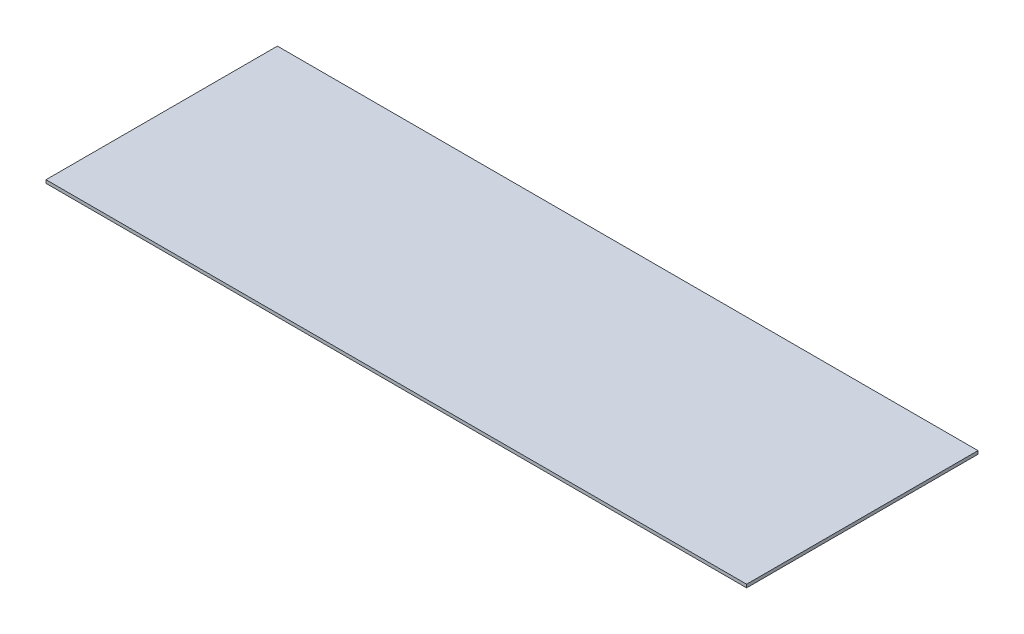
ISO-10303-21;
HEADER;
FILE_DESCRIPTION(('STEP AP214'),'2;1');
FILE_NAME('part.step','',(''),(''),'','','');
FILE_SCHEMA(('AUTOMOTIVE_DESIGN { 1 0 10303 214 1 1 1 1 }'));
ENDSEC;
DATA;
#1=APPLICATION_CONTEXT('core data for automotive mechanical design processes');
#2=APPLICATION_PROTOCOL_DEFINITION('international standard','automotive_design',2000,#1);
#3=PRODUCT_CONTEXT('',#1,'mechanical');
#4=PRODUCT('Part','Part','',(#3));
#5=PRODUCT_RELATED_PRODUCT_CATEGORY('part','',(#4));
#6=PRODUCT_DEFINITION_FORMATION('','',#4);
#7=PRODUCT_DEFINITION_CONTEXT('part definition',#1,'design');
#8=PRODUCT_DEFINITION('design','',#6,#7);
#9=PRODUCT_DEFINITION_SHAPE('','',#8);
#10=(LENGTH_UNIT() NAMED_UNIT(*) SI_UNIT(.MILLI.,.METRE.));
#11=(NAMED_UNIT(*) PLANE_ANGLE_UNIT() SI_UNIT($,.RADIAN.));
#12=(NAMED_UNIT(*) SI_UNIT($,.STERADIAN.) SOLID_ANGLE_UNIT());
#13=UNCERTAINTY_MEASURE_WITH_UNIT(LENGTH_MEASURE(1.E-05),#10,'distance_accuracy_value','');
#14=(GEOMETRIC_REPRESENTATION_CONTEXT(3) GLOBAL_UNCERTAINTY_ASSIGNED_CONTEXT((#13)) GLOBAL_UNIT_ASSIGNED_CONTEXT((#10,
#11,#12)) REPRESENTATION_CONTEXT('',''));
#15=CARTESIAN_POINT('',(0.,0.,0.));
#16=DIRECTION('',(0.,0.,1.));
#17=DIRECTION('',(1.,0.,0.));
#18=AXIS2_PLACEMENT_3D('',#15,#16,#17);
#19=CARTESIAN_POINT('',(-1047.64871435823,5.,-331.739130434783));
#20=DIRECTION('',(1.,0.,0.));
#21=DIRECTION('',(0.,0.,-1.));
#22=AXIS2_PLACEMENT_3D('',#19,#20,#21);
#23=PLANE('',#22);
#24=DIRECTION('',(0.,0.,1.));
#25=VECTOR('',#24,1.);
#26=CARTESIAN_POINT('',(-1047.64871435823,0.,-331.739130434783));
#27=LINE('',#26,#25);
#28=CARTESIAN_POINT('',(-1047.64871435823,0.,-331.739130434783));
#29=VERTEX_POINT('',#28);
#30=CARTESIAN_POINT('',(-1047.64871435823,0.,28.2608695652174));
#31=VERTEX_POINT('',#30);
#32=EDGE_CURVE('E109',#29,#31,#27,.T.);
#33=ORIENTED_EDGE('',*,*,#32,.T.);
#34=DIRECTION('',(0.,-1.,0.));
#35=VECTOR('',#34,1.);
#36=CARTESIAN_POINT('',(-1047.64871435823,5.,28.2608695652174));
#37=LINE('',#36,#35);
#38=CARTESIAN_POINT('',(-1047.64871435823,5.,28.2608695652174));
#39=VERTEX_POINT('',#38);
#40=EDGE_CURVE('E11',#39,#31,#37,.T.);
#41=ORIENTED_EDGE('',*,*,#40,.F.);
#42=DIRECTION('',(0.,0.,1.));
#43=VECTOR('',#42,1.);
#44=CARTESIAN_POINT('',(-1047.64871435823,5.,-331.739130434783));
#45=LINE('',#44,#43);
#46=CARTESIAN_POINT('',(-1047.64871435823,5.,-331.739130434783));
#47=VERTEX_POINT('',#46);
#48=EDGE_CURVE('E93',#47,#39,#45,.T.);
#49=ORIENTED_EDGE('',*,*,#48,.F.);
#50=DIRECTION('',(0.,-1.,0.));
#51=VECTOR('',#50,1.);
#52=CARTESIAN_POINT('',(-1047.64871435823,5.,-331.739130434783));
#53=LINE('',#52,#51);
#54=EDGE_CURVE('E105',#47,#29,#53,.T.);
#55=ORIENTED_EDGE('',*,*,#54,.T.);
#56=EDGE_LOOP('',(#33,#41,#49,#55));
#57=FACE_BOUND('',#56,.T.);
#58=ADVANCED_FACE('F41',(#57),#23,.F.);
#59=CARTESIAN_POINT('',(-1047.64871435823,5.,28.2608695652174));
#60=DIRECTION('',(0.,0.,-1.));
#61=DIRECTION('',(-1.,0.,0.));
#62=AXIS2_PLACEMENT_3D('',#59,#60,#61);
#63=PLANE('',#62);
#64=DIRECTION('',(1.,0.,0.));
#65=VECTOR('',#64,1.);
#66=CARTESIAN_POINT('',(-1047.64871435823,0.,28.2608695652174));
#67=LINE('',#66,#65);
#68=CARTESIAN_POINT('',(42.351285641768,0.,28.2608695652174));
#69=VERTEX_POINT('',#68);
#70=EDGE_CURVE('E98',#31,#69,#67,.T.);
#71=ORIENTED_EDGE('',*,*,#70,.T.);
#72=DIRECTION('',(0.,-1.,0.));
#73=VECTOR('',#72,1.);
#74=CARTESIAN_POINT('',(42.351285641768,5.,28.2608695652174));
#75=LINE('',#74,#73);
#76=CARTESIAN_POINT('',(42.351285641768,5.,28.2608695652174));
#77=VERTEX_POINT('',#76);
#78=EDGE_CURVE('E50',#77,#69,#75,.T.);
#79=ORIENTED_EDGE('',*,*,#78,.F.);
#80=DIRECTION('',(1.,0.,0.));
#81=VECTOR('',#80,1.);
#82=CARTESIAN_POINT('',(-1047.64871435823,5.,28.2608695652174));
#83=LINE('',#82,#81);
#84=EDGE_CURVE('E88',#39,#77,#83,.T.);
#85=ORIENTED_EDGE('',*,*,#84,.F.);
#86=ORIENTED_EDGE('',*,*,#40,.T.);
#87=EDGE_LOOP('',(#71,#79,#85,#86));
#88=FACE_BOUND('',#87,.T.);
#89=ADVANCED_FACE('F97',(#88),#63,.F.);
#90=CARTESIAN_POINT('',(42.351285641768,5.,-331.739130434783));
#91=DIRECTION('',(-1.,0.,0.));
#92=DIRECTION('',(0.,0.,1.));
#93=AXIS2_PLACEMENT_3D('',#90,#91,#92);
#94=PLANE('',#93);
#95=DIRECTION('',(0.,0.,-1.));
#96=VECTOR('',#95,1.);
#97=CARTESIAN_POINT('',(42.351285641768,0.,-331.739130434783));
#98=LINE('',#97,#96);
#99=CARTESIAN_POINT('',(42.351285641768,0.,-331.739130434783));
#100=VERTEX_POINT('',#99);
#101=EDGE_CURVE('E75',#69,#100,#98,.T.);
#102=ORIENTED_EDGE('',*,*,#101,.T.);
#103=DIRECTION('',(0.,-1.,0.));
#104=VECTOR('',#103,1.);
#105=CARTESIAN_POINT('',(42.351285641768,5.,-331.739130434783));
#106=LINE('',#105,#104);
#107=CARTESIAN_POINT('',(42.351285641768,5.,-331.739130434783));
#108=VERTEX_POINT('',#107);
#109=EDGE_CURVE('E100',#108,#100,#106,.T.);
#110=ORIENTED_EDGE('',*,*,#109,.F.);
#111=DIRECTION('',(0.,0.,-1.));
#112=VECTOR('',#111,1.);
#113=CARTESIAN_POINT('',(42.351285641768,5.,-331.739130434783));
#114=LINE('',#113,#112);
#115=EDGE_CURVE('E91',#77,#108,#114,.T.);
#116=ORIENTED_EDGE('',*,*,#115,.F.);
#117=ORIENTED_EDGE('',*,*,#78,.T.);
#118=EDGE_LOOP('',(#102,#110,#116,#117));
#119=FACE_BOUND('',#118,.T.);
#120=ADVANCED_FACE('F101',(#119),#94,.F.);
#121=CARTESIAN_POINT('',(-1047.64871435823,5.,-331.739130434783));
#122=DIRECTION('',(0.,0.,1.));
#123=DIRECTION('',(1.,0.,0.));
#124=AXIS2_PLACEMENT_3D('',#121,#122,#123);
#125=PLANE('',#124);
#126=DIRECTION('',(-1.,0.,0.));
#127=VECTOR('',#126,1.);
#128=CARTESIAN_POINT('',(-1047.64871435823,0.,-331.739130434783));
#129=LINE('',#128,#127);
#130=EDGE_CURVE('E81',#100,#29,#129,.T.);
#131=ORIENTED_EDGE('',*,*,#130,.T.);
#132=ORIENTED_EDGE('',*,*,#54,.F.);
#133=DIRECTION('',(-1.,0.,0.));
#134=VECTOR('',#133,1.);
#135=CARTESIAN_POINT('',(-1047.64871435823,5.,-331.739130434783));
#136=LINE('',#135,#134);
#137=EDGE_CURVE('E58',#108,#47,#136,.T.);
#138=ORIENTED_EDGE('',*,*,#137,.F.);
#139=ORIENTED_EDGE('',*,*,#109,.T.);
#140=EDGE_LOOP('',(#131,#132,#138,#139));
#141=FACE_BOUND('',#140,.T.);
#142=ADVANCED_FACE('F122',(#141),#125,.F.);
#143=CARTESIAN_POINT('',(0.,5.,0.));
#144=DIRECTION('',(0.,1.,0.));
#145=DIRECTION('',(0.,0.,1.));
#146=AXIS2_PLACEMENT_3D('',#143,#144,#145);
#147=PLANE('',#146);
#148=ORIENTED_EDGE('',*,*,#48,.T.);
#149=ORIENTED_EDGE('',*,*,#84,.T.);
#150=ORIENTED_EDGE('',*,*,#115,.T.);
#151=ORIENTED_EDGE('',*,*,#137,.T.);
#152=EDGE_LOOP('',(#148,#149,#150,#151));
#153=FACE_BOUND('',#152,.T.);
#154=ADVANCED_FACE('F89',(#153),#147,.T.);
#155=CARTESIAN_POINT('',(0.,0.,0.));
#156=DIRECTION('',(0.,1.,0.));
#157=DIRECTION('',(0.,0.,1.));
#158=AXIS2_PLACEMENT_3D('',#155,#156,#157);
#159=PLANE('',#158);
#160=ORIENTED_EDGE('',*,*,#32,.F.);
#161=ORIENTED_EDGE('',*,*,#130,.F.);
#162=ORIENTED_EDGE('',*,*,#101,.F.);
#163=ORIENTED_EDGE('',*,*,#70,.F.);
#164=EDGE_LOOP('',(#160,#161,#162,#163));
#165=FACE_BOUND('',#164,.T.);
#166=ADVANCED_FACE('F125',(#165),#159,.F.);
#167=CLOSED_SHELL('',(#58,#89,#120,#142,#154,#166));
#168=MANIFOLD_SOLID_BREP('B2',#167);
#169=ADVANCED_BREP_SHAPE_REPRESENTATION('',(#18,#168),#14);
#170=SHAPE_DEFINITION_REPRESENTATION(#9,#169);
ENDSEC;
END-ISO-10303-21;
